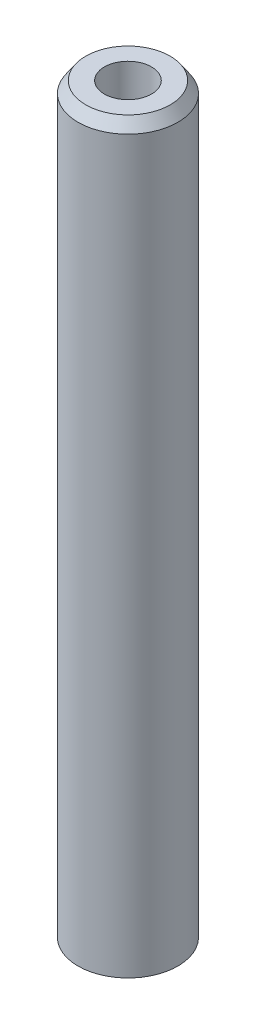
ISO-10303-21;
HEADER;
FILE_DESCRIPTION(('STEP AP214'),'2;1');
FILE_NAME('part.step','',(''),(''),'','','');
FILE_SCHEMA(('AUTOMOTIVE_DESIGN { 1 0 10303 214 1 1 1 1 }'));
ENDSEC;
DATA;
#1=APPLICATION_CONTEXT('core data for automotive mechanical design processes');
#2=APPLICATION_PROTOCOL_DEFINITION('international standard','automotive_design',2000,#1);
#3=PRODUCT_CONTEXT('',#1,'mechanical');
#4=PRODUCT('Part','Part','',(#3));
#5=PRODUCT_RELATED_PRODUCT_CATEGORY('part','',(#4));
#6=PRODUCT_DEFINITION_FORMATION('','',#4);
#7=PRODUCT_DEFINITION_CONTEXT('part definition',#1,'design');
#8=PRODUCT_DEFINITION('design','',#6,#7);
#9=PRODUCT_DEFINITION_SHAPE('','',#8);
#10=(LENGTH_UNIT() NAMED_UNIT(*) SI_UNIT(.MILLI.,.METRE.));
#11=(NAMED_UNIT(*) PLANE_ANGLE_UNIT() SI_UNIT($,.RADIAN.));
#12=(NAMED_UNIT(*) SI_UNIT($,.STERADIAN.) SOLID_ANGLE_UNIT());
#13=UNCERTAINTY_MEASURE_WITH_UNIT(LENGTH_MEASURE(1.E-05),#10,'distance_accuracy_value','');
#14=(GEOMETRIC_REPRESENTATION_CONTEXT(3) GLOBAL_UNCERTAINTY_ASSIGNED_CONTEXT((#13)) GLOBAL_UNIT_ASSIGNED_CONTEXT((#10,
#11,#12)) REPRESENTATION_CONTEXT('',''));
#15=CARTESIAN_POINT('',(0.,0.,0.));
#16=DIRECTION('',(0.,0.,1.));
#17=DIRECTION('',(1.,0.,0.));
#18=AXIS2_PLACEMENT_3D('',#15,#16,#17);
#19=CARTESIAN_POINT('',(0.,150.184684520695,0.));
#20=DIRECTION('',(0.,-1.,0.));
#21=DIRECTION('',(0.,0.,-1.));
#22=AXIS2_PLACEMENT_3D('',#19,#20,#21);
#23=CYLINDRICAL_SURFACE('',#22,10.);
#24=CARTESIAN_POINT('',(0.,147.930122836161,0.));
#25=DIRECTION('',(0.,1.,0.));
#26=DIRECTION('',(0.,0.,1.));
#27=AXIS2_PLACEMENT_3D('',#24,#25,#26);
#28=CIRCLE('',#27,10.);
#29=CARTESIAN_POINT('',(0.,147.930122836161,10.));
#30=VERTEX_POINT('',#29);
#31=EDGE_CURVE('E50',#30,#30,#28,.F.);
#32=ORIENTED_EDGE('',*,*,#31,.T.);
#33=EDGE_LOOP('',(#32));
#34=FACE_BOUND('',#33,.T.);
#35=CARTESIAN_POINT('',(0.,1.54138313648616,0.));
#36=DIRECTION('',(0.,1.,0.));
#37=DIRECTION('',(0.,0.,1.));
#38=AXIS2_PLACEMENT_3D('',#35,#36,#37);
#39=CIRCLE('',#38,10.);
#40=CARTESIAN_POINT('',(0.,1.54138313648616,10.));
#41=VERTEX_POINT('',#40);
#42=EDGE_CURVE('E51',#41,#41,#39,.T.);
#43=ORIENTED_EDGE('',*,*,#42,.T.);
#44=EDGE_LOOP('',(#43));
#45=FACE_BOUND('',#44,.T.);
#46=ADVANCED_FACE('F39',(#34,#45),#23,.T.);
#47=CARTESIAN_POINT('',(0.,150.184684520695,0.));
#48=DIRECTION('',(0.,1.,0.));
#49=DIRECTION('',(0.,0.,1.));
#50=AXIS2_PLACEMENT_3D('',#47,#48,#49);
#51=PLANE('',#50);
#52=CARTESIAN_POINT('',(0.,150.184684520695,0.));
#53=DIRECTION('',(0.,1.,0.));
#54=DIRECTION('',(0.,0.,1.));
#55=AXIS2_PLACEMENT_3D('',#52,#53,#54);
#56=CIRCLE('',#55,8.45861686351382);
#57=CARTESIAN_POINT('',(0.,150.184684520695,8.45861686351382));
#58=VERTEX_POINT('',#57);
#59=EDGE_CURVE('E54',#58,#58,#56,.T.);
#60=ORIENTED_EDGE('',*,*,#59,.T.);
#61=EDGE_LOOP('',(#60));
#62=FACE_BOUND('',#61,.T.);
#63=CARTESIAN_POINT('',(0.,150.184684520695,0.));
#64=DIRECTION('',(0.,1.,0.));
#65=DIRECTION('',(0.,0.,1.));
#66=AXIS2_PLACEMENT_3D('',#63,#64,#65);
#67=CIRCLE('',#66,4.72158231940535);
#68=CARTESIAN_POINT('',(0.,150.184684520695,4.72158231940535));
#69=VERTEX_POINT('',#68);
#70=EDGE_CURVE('E58',#69,#69,#67,.T.);
#71=ORIENTED_EDGE('',*,*,#70,.F.);
#72=EDGE_LOOP('',(#71));
#73=FACE_BOUND('',#72,.T.);
#74=ADVANCED_FACE('F69',(#62,#73),#51,.T.);
#75=CARTESIAN_POINT('',(0.,0.,0.));
#76=DIRECTION('',(0.,1.,0.));
#77=DIRECTION('',(0.,0.,1.));
#78=AXIS2_PLACEMENT_3D('',#75,#76,#77);
#79=PLANE('',#78);
#80=CARTESIAN_POINT('',(0.,0.,0.));
#81=DIRECTION('',(0.,1.,0.));
#82=DIRECTION('',(0.,0.,1.));
#83=AXIS2_PLACEMENT_3D('',#80,#81,#82);
#84=CIRCLE('',#83,7.74543831546597);
#85=CARTESIAN_POINT('',(0.,0.,7.74543831546597));
#86=VERTEX_POINT('',#85);
#87=EDGE_CURVE('E10',#86,#86,#84,.F.);
#88=ORIENTED_EDGE('',*,*,#87,.T.);
#89=EDGE_LOOP('',(#88));
#90=FACE_BOUND('',#89,.T.);
#91=CARTESIAN_POINT('',(0.,0.,0.));
#92=DIRECTION('',(0.,1.,0.));
#93=DIRECTION('',(0.,0.,1.));
#94=AXIS2_PLACEMENT_3D('',#91,#92,#93);
#95=CIRCLE('',#94,4.72158231940535);
#96=CARTESIAN_POINT('',(0.,0.,4.72158231940535));
#97=VERTEX_POINT('',#96);
#98=EDGE_CURVE('E63',#97,#97,#95,.T.);
#99=ORIENTED_EDGE('',*,*,#98,.T.);
#100=EDGE_LOOP('',(#99));
#101=FACE_BOUND('',#100,.T.);
#102=ADVANCED_FACE('F75',(#90,#101),#79,.F.);
#103=CARTESIAN_POINT('',(0.,150.184684520695,0.));
#104=DIRECTION('',(0.,-1.,0.));
#105=DIRECTION('',(0.,0.,-1.));
#106=AXIS2_PLACEMENT_3D('',#103,#104,#105);
#107=CYLINDRICAL_SURFACE('',#106,4.72158231940535);
#108=ORIENTED_EDGE('',*,*,#70,.T.);
#109=EDGE_LOOP('',(#108));
#110=FACE_BOUND('',#109,.T.);
#111=ORIENTED_EDGE('',*,*,#98,.F.);
#112=EDGE_LOOP('',(#111));
#113=FACE_BOUND('',#112,.T.);
#114=ADVANCED_FACE('F70',(#110,#113),#107,.F.);
#115=CARTESIAN_POINT('',(0.,150.184684520695,0.));
#116=DIRECTION('',(0.,-1.,0.));
#117=DIRECTION('',(0.,0.,-1.));
#118=AXIS2_PLACEMENT_3D('',#115,#116,#117);
#119=CONICAL_SURFACE('',#118,8.45861686351382,0.599684051464344);
#120=ORIENTED_EDGE('',*,*,#31,.F.);
#121=EDGE_LOOP('',(#120));
#122=FACE_BOUND('',#121,.T.);
#123=ORIENTED_EDGE('',*,*,#59,.F.);
#124=EDGE_LOOP('',(#123));
#125=FACE_BOUND('',#124,.T.);
#126=ADVANCED_FACE('F81',(#122,#125),#119,.T.);
#127=CARTESIAN_POINT('',(0.,1.54138313648616,0.));
#128=DIRECTION('',(0.,1.,0.));
#129=DIRECTION('',(0.,0.,1.));
#130=AXIS2_PLACEMENT_3D('',#127,#128,#129);
#131=CONICAL_SURFACE('',#130,10.,0.971112275330559);
#132=ORIENTED_EDGE('',*,*,#87,.F.);
#133=EDGE_LOOP('',(#132));
#134=FACE_BOUND('',#133,.T.);
#135=ORIENTED_EDGE('',*,*,#42,.F.);
#136=EDGE_LOOP('',(#135));
#137=FACE_BOUND('',#136,.T.);
#138=ADVANCED_FACE('F45',(#134,#137),#131,.T.);
#139=CLOSED_SHELL('',(#46,#74,#102,#114,#126,#138));
#140=MANIFOLD_SOLID_BREP('B2',#139);
#141=ADVANCED_BREP_SHAPE_REPRESENTATION('',(#18,#140),#14);
#142=SHAPE_DEFINITION_REPRESENTATION(#9,#141);
ENDSEC;
END-ISO-10303-21;
